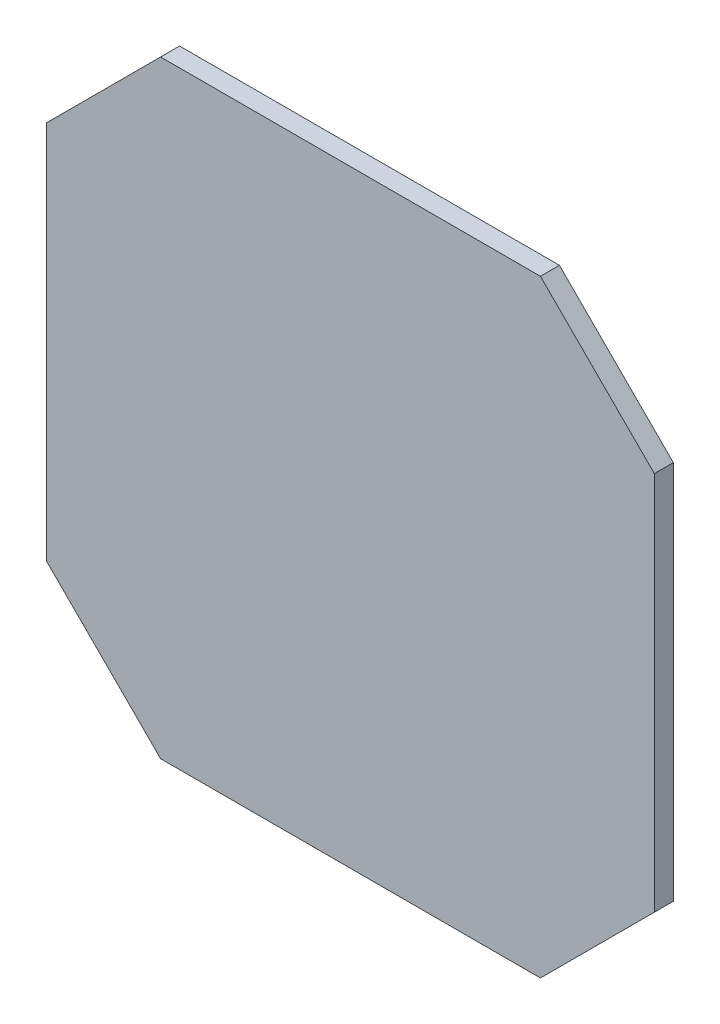
ISO-10303-21;
HEADER;
FILE_DESCRIPTION(('STEP AP214'),'2;1');
FILE_NAME('part.step','',(''),(''),'','','');
FILE_SCHEMA(('AUTOMOTIVE_DESIGN { 1 0 10303 214 1 1 1 1 }'));
ENDSEC;
DATA;
#1=APPLICATION_CONTEXT('core data for automotive mechanical design processes');
#2=APPLICATION_PROTOCOL_DEFINITION('international standard','automotive_design',2000,#1);
#3=PRODUCT_CONTEXT('',#1,'mechanical');
#4=PRODUCT('Part','Part','',(#3));
#5=PRODUCT_RELATED_PRODUCT_CATEGORY('part','',(#4));
#6=PRODUCT_DEFINITION_FORMATION('','',#4);
#7=PRODUCT_DEFINITION_CONTEXT('part definition',#1,'design');
#8=PRODUCT_DEFINITION('design','',#6,#7);
#9=PRODUCT_DEFINITION_SHAPE('','',#8);
#10=(LENGTH_UNIT() NAMED_UNIT(*) SI_UNIT(.MILLI.,.METRE.));
#11=(NAMED_UNIT(*) PLANE_ANGLE_UNIT() SI_UNIT($,.RADIAN.));
#12=(NAMED_UNIT(*) SI_UNIT($,.STERADIAN.) SOLID_ANGLE_UNIT());
#13=UNCERTAINTY_MEASURE_WITH_UNIT(LENGTH_MEASURE(1.E-05),#10,'distance_accuracy_value','');
#14=(GEOMETRIC_REPRESENTATION_CONTEXT(3) GLOBAL_UNCERTAINTY_ASSIGNED_CONTEXT((#13)) GLOBAL_UNIT_ASSIGNED_CONTEXT((#10,
#11,#12)) REPRESENTATION_CONTEXT('',''));
#15=CARTESIAN_POINT('',(0.,0.,0.));
#16=DIRECTION('',(0.,0.,1.));
#17=DIRECTION('',(1.,0.,0.));
#18=AXIS2_PLACEMENT_3D('',#15,#16,#17);
#19=CARTESIAN_POINT('',(-80.,50.,5.));
#20=DIRECTION('',(1.,0.,0.));
#21=DIRECTION('',(0.,1.,0.));
#22=AXIS2_PLACEMENT_3D('',#19,#20,#21);
#23=PLANE('',#22);
#24=DIRECTION('',(0.,-1.,0.));
#25=VECTOR('',#24,1.);
#26=CARTESIAN_POINT('',(-80.,50.,0.));
#27=LINE('',#26,#25);
#28=CARTESIAN_POINT('',(-80.,50.,0.));
#29=VERTEX_POINT('',#28);
#30=CARTESIAN_POINT('',(-80.,-50.0000000000003,0.));
#31=VERTEX_POINT('',#30);
#32=EDGE_CURVE('E130',#29,#31,#27,.T.);
#33=ORIENTED_EDGE('',*,*,#32,.T.);
#34=DIRECTION('',(0.,0.,-1.));
#35=VECTOR('',#34,1.);
#36=CARTESIAN_POINT('',(-80.,-50.0000000000003,5.));
#37=LINE('',#36,#35);
#38=CARTESIAN_POINT('',(-80.,-50.0000000000003,5.));
#39=VERTEX_POINT('',#38);
#40=EDGE_CURVE('E11',#39,#31,#37,.T.);
#41=ORIENTED_EDGE('',*,*,#40,.F.);
#42=DIRECTION('',(0.,-1.,0.));
#43=VECTOR('',#42,1.);
#44=CARTESIAN_POINT('',(-80.,50.,5.));
#45=LINE('',#44,#43);
#46=CARTESIAN_POINT('',(-80.,50.,5.));
#47=VERTEX_POINT('',#46);
#48=EDGE_CURVE('E144',#47,#39,#45,.T.);
#49=ORIENTED_EDGE('',*,*,#48,.F.);
#50=DIRECTION('',(0.,0.,-1.));
#51=VECTOR('',#50,1.);
#52=CARTESIAN_POINT('',(-80.,50.,5.));
#53=LINE('',#52,#51);
#54=EDGE_CURVE('E126',#47,#29,#53,.T.);
#55=ORIENTED_EDGE('',*,*,#54,.T.);
#56=EDGE_LOOP('',(#33,#41,#49,#55));
#57=FACE_BOUND('',#56,.T.);
#58=ADVANCED_FACE('F34',(#57),#23,.F.);
#59=CARTESIAN_POINT('',(-80.,-50.0000000000003,5.));
#60=DIRECTION('',(0.707106781186544,0.707106781186551,0.));
#61=DIRECTION('',(-0.707106781186551,0.707106781186544,0.));
#62=AXIS2_PLACEMENT_3D('',#59,#60,#61);
#63=PLANE('',#62);
#64=DIRECTION('',(0.707106781186551,-0.707106781186544,0.));
#65=VECTOR('',#64,1.);
#66=CARTESIAN_POINT('',(-80.,-50.0000000000003,0.));
#67=LINE('',#66,#65);
#68=CARTESIAN_POINT('',(-50.,-80.,0.));
#69=VERTEX_POINT('',#68);
#70=EDGE_CURVE('E133',#31,#69,#67,.T.);
#71=ORIENTED_EDGE('',*,*,#70,.T.);
#72=DIRECTION('',(0.,0.,-1.));
#73=VECTOR('',#72,1.);
#74=CARTESIAN_POINT('',(-50.,-80.,5.));
#75=LINE('',#74,#73);
#76=CARTESIAN_POINT('',(-50.,-80.,5.));
#77=VERTEX_POINT('',#76);
#78=EDGE_CURVE('E42',#77,#69,#75,.T.);
#79=ORIENTED_EDGE('',*,*,#78,.F.);
#80=DIRECTION('',(0.707106781186551,-0.707106781186544,0.));
#81=VECTOR('',#80,1.);
#82=CARTESIAN_POINT('',(-80.,-50.0000000000003,5.));
#83=LINE('',#82,#81);
#84=EDGE_CURVE('E93',#39,#77,#83,.T.);
#85=ORIENTED_EDGE('',*,*,#84,.F.);
#86=ORIENTED_EDGE('',*,*,#40,.T.);
#87=EDGE_LOOP('',(#71,#79,#85,#86));
#88=FACE_BOUND('',#87,.T.);
#89=ADVANCED_FACE('F179',(#88),#63,.F.);
#90=CARTESIAN_POINT('',(-50.,-80.,5.));
#91=DIRECTION('',(0.,1.,0.));
#92=DIRECTION('',(0.,0.,1.));
#93=AXIS2_PLACEMENT_3D('',#90,#91,#92);
#94=PLANE('',#93);
#95=DIRECTION('',(1.,0.,0.));
#96=VECTOR('',#95,1.);
#97=CARTESIAN_POINT('',(-50.,-80.,0.));
#98=LINE('',#97,#96);
#99=CARTESIAN_POINT('',(50.0000000000003,-80.,0.));
#100=VERTEX_POINT('',#99);
#101=EDGE_CURVE('E135',#69,#100,#98,.T.);
#102=ORIENTED_EDGE('',*,*,#101,.T.);
#103=DIRECTION('',(0.,0.,-1.));
#104=VECTOR('',#103,1.);
#105=CARTESIAN_POINT('',(50.0000000000003,-80.,5.));
#106=LINE('',#105,#104);
#107=CARTESIAN_POINT('',(50.0000000000003,-80.,5.));
#108=VERTEX_POINT('',#107);
#109=EDGE_CURVE('E151',#108,#100,#106,.T.);
#110=ORIENTED_EDGE('',*,*,#109,.F.);
#111=DIRECTION('',(1.,0.,0.));
#112=VECTOR('',#111,1.);
#113=CARTESIAN_POINT('',(-50.,-80.,5.));
#114=LINE('',#113,#112);
#115=EDGE_CURVE('E159',#77,#108,#114,.T.);
#116=ORIENTED_EDGE('',*,*,#115,.F.);
#117=ORIENTED_EDGE('',*,*,#78,.T.);
#118=EDGE_LOOP('',(#102,#110,#116,#117));
#119=FACE_BOUND('',#118,.T.);
#120=ADVANCED_FACE('F157',(#119),#94,.F.);
#121=CARTESIAN_POINT('',(50.0000000000003,-80.,5.));
#122=DIRECTION('',(-0.707106781186552,0.707106781186544,0.));
#123=DIRECTION('',(-0.707106781186544,-0.707106781186551,0.));
#124=AXIS2_PLACEMENT_3D('',#121,#122,#123);
#125=PLANE('',#124);
#126=DIRECTION('',(0.707106781186544,0.707106781186552,0.));
#127=VECTOR('',#126,1.);
#128=CARTESIAN_POINT('',(50.0000000000003,-80.,0.));
#129=LINE('',#128,#127);
#130=CARTESIAN_POINT('',(80.,-50.,0.));
#131=VERTEX_POINT('',#130);
#132=EDGE_CURVE('E137',#100,#131,#129,.T.);
#133=ORIENTED_EDGE('',*,*,#132,.T.);
#134=DIRECTION('',(0.,0.,-1.));
#135=VECTOR('',#134,1.);
#136=CARTESIAN_POINT('',(80.,-50.,5.));
#137=LINE('',#136,#135);
#138=CARTESIAN_POINT('',(80.,-50.,5.));
#139=VERTEX_POINT('',#138);
#140=EDGE_CURVE('E148',#139,#131,#137,.T.);
#141=ORIENTED_EDGE('',*,*,#140,.F.);
#142=DIRECTION('',(0.707106781186544,0.707106781186552,0.));
#143=VECTOR('',#142,1.);
#144=CARTESIAN_POINT('',(50.0000000000003,-80.,5.));
#145=LINE('',#144,#143);
#146=EDGE_CURVE('E171',#108,#139,#145,.T.);
#147=ORIENTED_EDGE('',*,*,#146,.F.);
#148=ORIENTED_EDGE('',*,*,#109,.T.);
#149=EDGE_LOOP('',(#133,#141,#147,#148));
#150=FACE_BOUND('',#149,.T.);
#151=ADVANCED_FACE('F167',(#150),#125,.F.);
#152=CARTESIAN_POINT('',(80.,-50.,5.));
#153=DIRECTION('',(-1.,0.,0.));
#154=DIRECTION('',(0.,-1.,0.));
#155=AXIS2_PLACEMENT_3D('',#152,#153,#154);
#156=PLANE('',#155);
#157=DIRECTION('',(0.,1.,0.));
#158=VECTOR('',#157,1.);
#159=CARTESIAN_POINT('',(80.,-50.,0.));
#160=LINE('',#159,#158);
#161=CARTESIAN_POINT('',(80.,50.0000000000003,0.));
#162=VERTEX_POINT('',#161);
#163=EDGE_CURVE('E139',#131,#162,#160,.T.);
#164=ORIENTED_EDGE('',*,*,#163,.T.);
#165=DIRECTION('',(0.,0.,-1.));
#166=VECTOR('',#165,1.);
#167=CARTESIAN_POINT('',(80.,50.0000000000003,5.));
#168=LINE('',#167,#166);
#169=CARTESIAN_POINT('',(80.,50.0000000000003,5.));
#170=VERTEX_POINT('',#169);
#171=EDGE_CURVE('E121',#170,#162,#168,.T.);
#172=ORIENTED_EDGE('',*,*,#171,.F.);
#173=DIRECTION('',(0.,1.,0.));
#174=VECTOR('',#173,1.);
#175=CARTESIAN_POINT('',(80.,-50.,5.));
#176=LINE('',#175,#174);
#177=EDGE_CURVE('E112',#139,#170,#176,.T.);
#178=ORIENTED_EDGE('',*,*,#177,.F.);
#179=ORIENTED_EDGE('',*,*,#140,.T.);
#180=EDGE_LOOP('',(#164,#172,#178,#179));
#181=FACE_BOUND('',#180,.T.);
#182=ADVANCED_FACE('F170',(#181),#156,.F.);
#183=CARTESIAN_POINT('',(80.,50.0000000000003,5.));
#184=DIRECTION('',(-0.707106781186544,-0.707106781186551,0.));
#185=DIRECTION('',(0.707106781186551,-0.707106781186544,0.));
#186=AXIS2_PLACEMENT_3D('',#183,#184,#185);
#187=PLANE('',#186);
#188=DIRECTION('',(-0.707106781186551,0.707106781186544,0.));
#189=VECTOR('',#188,1.);
#190=CARTESIAN_POINT('',(80.,50.0000000000003,0.));
#191=LINE('',#190,#189);
#192=CARTESIAN_POINT('',(50.,80.,0.));
#193=VERTEX_POINT('',#192);
#194=EDGE_CURVE('E120',#162,#193,#191,.T.);
#195=ORIENTED_EDGE('',*,*,#194,.T.);
#196=DIRECTION('',(0.,0.,-1.));
#197=VECTOR('',#196,1.);
#198=CARTESIAN_POINT('',(50.,80.,5.));
#199=LINE('',#198,#197);
#200=CARTESIAN_POINT('',(50.,80.,5.));
#201=VERTEX_POINT('',#200);
#202=EDGE_CURVE('E117',#201,#193,#199,.T.);
#203=ORIENTED_EDGE('',*,*,#202,.F.);
#204=DIRECTION('',(-0.707106781186551,0.707106781186544,0.));
#205=VECTOR('',#204,1.);
#206=CARTESIAN_POINT('',(80.,50.0000000000003,5.));
#207=LINE('',#206,#205);
#208=EDGE_CURVE('E106',#170,#201,#207,.T.);
#209=ORIENTED_EDGE('',*,*,#208,.F.);
#210=ORIENTED_EDGE('',*,*,#171,.T.);
#211=EDGE_LOOP('',(#195,#203,#209,#210));
#212=FACE_BOUND('',#211,.T.);
#213=ADVANCED_FACE('F118',(#212),#187,.F.);
#214=CARTESIAN_POINT('',(50.,80.,5.));
#215=DIRECTION('',(0.,-1.,0.));
#216=DIRECTION('',(1.,0.,0.));
#217=AXIS2_PLACEMENT_3D('',#214,#215,#216);
#218=PLANE('',#217);
#219=DIRECTION('',(-1.,0.,0.));
#220=VECTOR('',#219,1.);
#221=CARTESIAN_POINT('',(50.,80.,0.));
#222=LINE('',#221,#220);
#223=CARTESIAN_POINT('',(-50.0000000000004,80.,0.));
#224=VERTEX_POINT('',#223);
#225=EDGE_CURVE('E79',#193,#224,#222,.T.);
#226=ORIENTED_EDGE('',*,*,#225,.T.);
#227=DIRECTION('',(0.,0.,-1.));
#228=VECTOR('',#227,1.);
#229=CARTESIAN_POINT('',(-50.0000000000004,80.,5.));
#230=LINE('',#229,#228);
#231=CARTESIAN_POINT('',(-50.0000000000004,80.,5.));
#232=VERTEX_POINT('',#231);
#233=EDGE_CURVE('E122',#232,#224,#230,.T.);
#234=ORIENTED_EDGE('',*,*,#233,.F.);
#235=DIRECTION('',(-1.,0.,0.));
#236=VECTOR('',#235,1.);
#237=CARTESIAN_POINT('',(50.,80.,5.));
#238=LINE('',#237,#236);
#239=EDGE_CURVE('E110',#201,#232,#238,.T.);
#240=ORIENTED_EDGE('',*,*,#239,.F.);
#241=ORIENTED_EDGE('',*,*,#202,.T.);
#242=EDGE_LOOP('',(#226,#234,#240,#241));
#243=FACE_BOUND('',#242,.T.);
#244=ADVANCED_FACE('F124',(#243),#218,.F.);
#245=CARTESIAN_POINT('',(-50.0000000000004,80.,5.));
#246=DIRECTION('',(0.707106781186551,-0.707106781186544,0.));
#247=DIRECTION('',(0.707106781186544,0.707106781186551,0.));
#248=AXIS2_PLACEMENT_3D('',#245,#246,#247);
#249=PLANE('',#248);
#250=DIRECTION('',(-0.707106781186544,-0.707106781186551,0.));
#251=VECTOR('',#250,1.);
#252=CARTESIAN_POINT('',(-50.0000000000004,80.,0.));
#253=LINE('',#252,#251);
#254=EDGE_CURVE('E85',#224,#29,#253,.T.);
#255=ORIENTED_EDGE('',*,*,#254,.T.);
#256=ORIENTED_EDGE('',*,*,#54,.F.);
#257=DIRECTION('',(-0.707106781186544,-0.707106781186551,0.));
#258=VECTOR('',#257,1.);
#259=CARTESIAN_POINT('',(-50.0000000000004,80.,5.));
#260=LINE('',#259,#258);
#261=EDGE_CURVE('E50',#232,#47,#260,.T.);
#262=ORIENTED_EDGE('',*,*,#261,.F.);
#263=ORIENTED_EDGE('',*,*,#233,.T.);
#264=EDGE_LOOP('',(#255,#256,#262,#263));
#265=FACE_BOUND('',#264,.T.);
#266=ADVANCED_FACE('F195',(#265),#249,.F.);
#267=CARTESIAN_POINT('',(0.,0.,5.));
#268=DIRECTION('',(0.,0.,1.));
#269=DIRECTION('',(1.,0.,0.));
#270=AXIS2_PLACEMENT_3D('',#267,#268,#269);
#271=PLANE('',#270);
#272=ORIENTED_EDGE('',*,*,#48,.T.);
#273=ORIENTED_EDGE('',*,*,#84,.T.);
#274=ORIENTED_EDGE('',*,*,#115,.T.);
#275=ORIENTED_EDGE('',*,*,#146,.T.);
#276=ORIENTED_EDGE('',*,*,#177,.T.);
#277=ORIENTED_EDGE('',*,*,#208,.T.);
#278=ORIENTED_EDGE('',*,*,#239,.T.);
#279=ORIENTED_EDGE('',*,*,#261,.T.);
#280=EDGE_LOOP('',(#272,#273,#274,#275,#276,#277,#278,#279));
#281=FACE_BOUND('',#280,.T.);
#282=ADVANCED_FACE('F108',(#281),#271,.T.);
#283=CARTESIAN_POINT('',(0.,0.,0.));
#284=DIRECTION('',(0.,0.,1.));
#285=DIRECTION('',(1.,0.,0.));
#286=AXIS2_PLACEMENT_3D('',#283,#284,#285);
#287=PLANE('',#286);
#288=ORIENTED_EDGE('',*,*,#32,.F.);
#289=ORIENTED_EDGE('',*,*,#254,.F.);
#290=ORIENTED_EDGE('',*,*,#225,.F.);
#291=ORIENTED_EDGE('',*,*,#194,.F.);
#292=ORIENTED_EDGE('',*,*,#163,.F.);
#293=ORIENTED_EDGE('',*,*,#132,.F.);
#294=ORIENTED_EDGE('',*,*,#101,.F.);
#295=ORIENTED_EDGE('',*,*,#70,.F.);
#296=EDGE_LOOP('',(#288,#289,#290,#291,#292,#293,#294,#295));
#297=FACE_BOUND('',#296,.T.);
#298=ADVANCED_FACE('F163',(#297),#287,.F.);
#299=CLOSED_SHELL('',(#58,#89,#120,#151,#182,#213,#244,#266,#282,#298));
#300=MANIFOLD_SOLID_BREP('B2',#299);
#301=ADVANCED_BREP_SHAPE_REPRESENTATION('',(#18,#300),#14);
#302=SHAPE_DEFINITION_REPRESENTATION(#9,#301);
ENDSEC;
END-ISO-10303-21;
